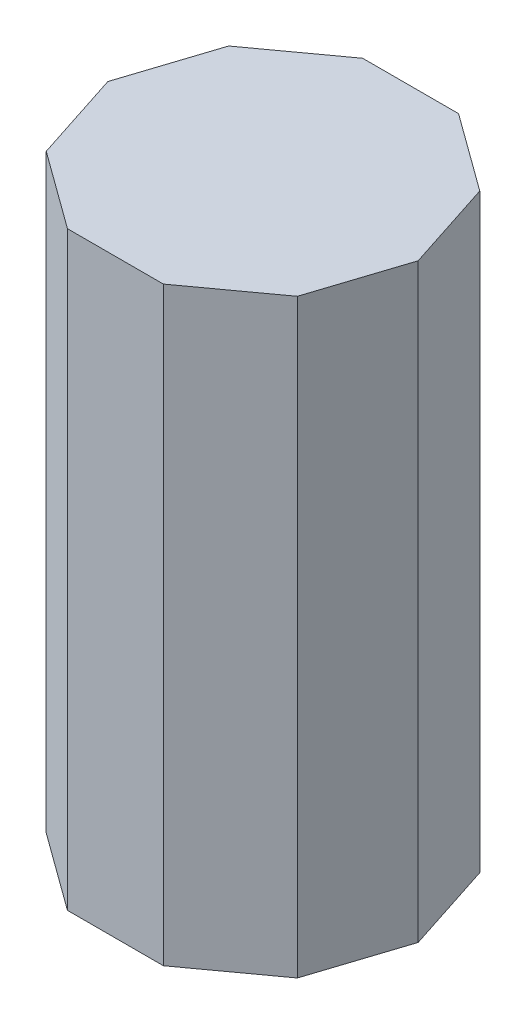
ISO-10303-21;
HEADER;
FILE_DESCRIPTION(('STEP AP214'),'2;1');
FILE_NAME('part.step','',(''),(''),'','','');
FILE_SCHEMA(('AUTOMOTIVE_DESIGN { 1 0 10303 214 1 1 1 1 }'));
ENDSEC;
DATA;
#1=APPLICATION_CONTEXT('core data for automotive mechanical design processes');
#2=APPLICATION_PROTOCOL_DEFINITION('international standard','automotive_design',2000,#1);
#3=PRODUCT_CONTEXT('',#1,'mechanical');
#4=PRODUCT('Part','Part','',(#3));
#5=PRODUCT_RELATED_PRODUCT_CATEGORY('part','',(#4));
#6=PRODUCT_DEFINITION_FORMATION('','',#4);
#7=PRODUCT_DEFINITION_CONTEXT('part definition',#1,'design');
#8=PRODUCT_DEFINITION('design','',#6,#7);
#9=PRODUCT_DEFINITION_SHAPE('','',#8);
#10=(LENGTH_UNIT() NAMED_UNIT(*) SI_UNIT(.MILLI.,.METRE.));
#11=(NAMED_UNIT(*) PLANE_ANGLE_UNIT() SI_UNIT($,.RADIAN.));
#12=(NAMED_UNIT(*) SI_UNIT($,.STERADIAN.) SOLID_ANGLE_UNIT());
#13=UNCERTAINTY_MEASURE_WITH_UNIT(LENGTH_MEASURE(1.E-05),#10,'distance_accuracy_value','');
#14=(GEOMETRIC_REPRESENTATION_CONTEXT(3) GLOBAL_UNCERTAINTY_ASSIGNED_CONTEXT((#13)) GLOBAL_UNIT_ASSIGNED_CONTEXT((#10,
#11,#12)) REPRESENTATION_CONTEXT('',''));
#15=CARTESIAN_POINT('',(0.,0.,0.));
#16=DIRECTION('',(0.,0.,1.));
#17=DIRECTION('',(1.,0.,0.));
#18=AXIS2_PLACEMENT_3D('',#15,#16,#17);
#19=CARTESIAN_POINT('',(1.62459848116453,20.,5.));
#20=DIRECTION('',(-0.587785252292474,0.,-0.809016994374947));
#21=DIRECTION('',(-0.809016994374947,0.,0.587785252292474));
#22=AXIS2_PLACEMENT_3D('',#19,#20,#21);
#23=PLANE('',#22);
#24=DIRECTION('',(0.809016994374947,0.,-0.587785252292474));
#25=VECTOR('',#24,1.);
#26=CARTESIAN_POINT('',(1.62459848116453,0.,5.));
#27=LINE('',#26,#25);
#28=CARTESIAN_POINT('',(1.62459848116453,0.,5.));
#29=VERTEX_POINT('',#28);
#30=CARTESIAN_POINT('',(4.2532540417602,0.,3.09016994374947));
#31=VERTEX_POINT('',#30);
#32=EDGE_CURVE('E110',#29,#31,#27,.T.);
#33=ORIENTED_EDGE('',*,*,#32,.T.);
#34=DIRECTION('',(0.,-1.,0.));
#35=VECTOR('',#34,1.);
#36=CARTESIAN_POINT('',(4.2532540417602,20.,3.09016994374947));
#37=LINE('',#36,#35);
#38=CARTESIAN_POINT('',(4.2532540417602,20.,3.09016994374947));
#39=VERTEX_POINT('',#38);
#40=EDGE_CURVE('E11',#39,#31,#37,.T.);
#41=ORIENTED_EDGE('',*,*,#40,.F.);
#42=DIRECTION('',(0.809016994374947,0.,-0.587785252292474));
#43=VECTOR('',#42,1.);
#44=CARTESIAN_POINT('',(1.62459848116453,20.,5.));
#45=LINE('',#44,#43);
#46=CARTESIAN_POINT('',(1.62459848116453,20.,5.));
#47=VERTEX_POINT('',#46);
#48=EDGE_CURVE('E141',#47,#39,#45,.T.);
#49=ORIENTED_EDGE('',*,*,#48,.F.);
#50=DIRECTION('',(0.,-1.,0.));
#51=VECTOR('',#50,1.);
#52=CARTESIAN_POINT('',(1.62459848116453,20.,5.));
#53=LINE('',#52,#51);
#54=EDGE_CURVE('E123',#47,#29,#53,.T.);
#55=ORIENTED_EDGE('',*,*,#54,.T.);
#56=EDGE_LOOP('',(#33,#41,#49,#55));
#57=FACE_BOUND('',#56,.T.);
#58=ADVANCED_FACE('F30',(#57),#23,.F.);
#59=CARTESIAN_POINT('',(4.2532540417602,20.,3.09016994374947));
#60=DIRECTION('',(-0.951056516295154,0.,-0.309016994374947));
#61=DIRECTION('',(-0.309016994374947,0.,0.951056516295154));
#62=AXIS2_PLACEMENT_3D('',#59,#60,#61);
#63=PLANE('',#62);
#64=DIRECTION('',(0.309016994374947,0.,-0.951056516295154));
#65=VECTOR('',#64,1.);
#66=CARTESIAN_POINT('',(4.2532540417602,0.,3.09016994374947));
#67=LINE('',#66,#65);
#68=CARTESIAN_POINT('',(5.25731112119134,0.,0.));
#69=VERTEX_POINT('',#68);
#70=EDGE_CURVE('E106',#31,#69,#67,.T.);
#71=ORIENTED_EDGE('',*,*,#70,.T.);
#72=DIRECTION('',(0.,-1.,0.));
#73=VECTOR('',#72,1.);
#74=CARTESIAN_POINT('',(5.25731112119134,20.,0.));
#75=LINE('',#74,#73);
#76=CARTESIAN_POINT('',(5.25731112119134,20.,0.));
#77=VERTEX_POINT('',#76);
#78=EDGE_CURVE('E37',#77,#69,#75,.T.);
#79=ORIENTED_EDGE('',*,*,#78,.F.);
#80=DIRECTION('',(0.309016994374947,0.,-0.951056516295154));
#81=VECTOR('',#80,1.);
#82=CARTESIAN_POINT('',(4.2532540417602,20.,3.09016994374947));
#83=LINE('',#82,#81);
#84=EDGE_CURVE('E119',#39,#77,#83,.T.);
#85=ORIENTED_EDGE('',*,*,#84,.F.);
#86=ORIENTED_EDGE('',*,*,#40,.T.);
#87=EDGE_LOOP('',(#71,#79,#85,#86));
#88=FACE_BOUND('',#87,.T.);
#89=ADVANCED_FACE('F118',(#88),#63,.F.);
#90=CARTESIAN_POINT('',(5.25731112119134,20.,0.));
#91=DIRECTION('',(-0.951056516295154,0.,0.309016994374947));
#92=DIRECTION('',(0.309016994374947,0.,0.951056516295154));
#93=AXIS2_PLACEMENT_3D('',#90,#91,#92);
#94=PLANE('',#93);
#95=DIRECTION('',(-0.309016994374947,0.,-0.951056516295154));
#96=VECTOR('',#95,1.);
#97=CARTESIAN_POINT('',(5.25731112119134,0.,0.));
#98=LINE('',#97,#96);
#99=CARTESIAN_POINT('',(4.25325404176021,0.,-3.09016994374946));
#100=VERTEX_POINT('',#99);
#101=EDGE_CURVE('E112',#69,#100,#98,.T.);
#102=ORIENTED_EDGE('',*,*,#101,.T.);
#103=DIRECTION('',(0.,-1.,0.));
#104=VECTOR('',#103,1.);
#105=CARTESIAN_POINT('',(4.25325404176021,20.,-3.09016994374946));
#106=LINE('',#105,#104);
#107=CARTESIAN_POINT('',(4.25325404176021,20.,-3.09016994374946));
#108=VERTEX_POINT('',#107);
#109=EDGE_CURVE('E177',#108,#100,#106,.T.);
#110=ORIENTED_EDGE('',*,*,#109,.F.);
#111=DIRECTION('',(-0.309016994374947,0.,-0.951056516295154));
#112=VECTOR('',#111,1.);
#113=CARTESIAN_POINT('',(5.25731112119134,20.,0.));
#114=LINE('',#113,#112);
#115=EDGE_CURVE('E144',#77,#108,#114,.T.);
#116=ORIENTED_EDGE('',*,*,#115,.F.);
#117=ORIENTED_EDGE('',*,*,#78,.T.);
#118=EDGE_LOOP('',(#102,#110,#116,#117));
#119=FACE_BOUND('',#118,.T.);
#120=ADVANCED_FACE('F181',(#119),#94,.F.);
#121=CARTESIAN_POINT('',(4.25325404176021,20.,-3.09016994374946));
#122=DIRECTION('',(-0.587785252292473,0.,0.809016994374947));
#123=DIRECTION('',(0.809016994374947,0.,0.587785252292473));
#124=AXIS2_PLACEMENT_3D('',#121,#122,#123);
#125=PLANE('',#124);
#126=DIRECTION('',(-0.809016994374947,0.,-0.587785252292473));
#127=VECTOR('',#126,1.);
#128=CARTESIAN_POINT('',(4.25325404176021,0.,-3.09016994374946));
#129=LINE('',#128,#127);
#130=CARTESIAN_POINT('',(1.62459848116451,0.,-5.00000000000001));
#131=VERTEX_POINT('',#130);
#132=EDGE_CURVE('E127',#100,#131,#129,.T.);
#133=ORIENTED_EDGE('',*,*,#132,.T.);
#134=DIRECTION('',(0.,-1.,0.));
#135=VECTOR('',#134,1.);
#136=CARTESIAN_POINT('',(1.62459848116451,20.,-5.00000000000001));
#137=LINE('',#136,#135);
#138=CARTESIAN_POINT('',(1.62459848116451,20.,-5.00000000000001));
#139=VERTEX_POINT('',#138);
#140=EDGE_CURVE('E174',#139,#131,#137,.T.);
#141=ORIENTED_EDGE('',*,*,#140,.F.);
#142=DIRECTION('',(-0.809016994374947,0.,-0.587785252292473));
#143=VECTOR('',#142,1.);
#144=CARTESIAN_POINT('',(4.25325404176021,20.,-3.09016994374946));
#145=LINE('',#144,#143);
#146=EDGE_CURVE('E146',#108,#139,#145,.T.);
#147=ORIENTED_EDGE('',*,*,#146,.F.);
#148=ORIENTED_EDGE('',*,*,#109,.T.);
#149=EDGE_LOOP('',(#133,#141,#147,#148));
#150=FACE_BOUND('',#149,.T.);
#151=ADVANCED_FACE('F189',(#150),#125,.F.);
#152=CARTESIAN_POINT('',(1.62459848116451,20.,-5.00000000000001));
#153=DIRECTION('',(0.,0.,1.));
#154=DIRECTION('',(1.,0.,0.));
#155=AXIS2_PLACEMENT_3D('',#152,#153,#154);
#156=PLANE('',#155);
#157=DIRECTION('',(-1.,0.,0.));
#158=VECTOR('',#157,1.);
#159=CARTESIAN_POINT('',(1.62459848116451,0.,-5.00000000000001));
#160=LINE('',#159,#158);
#161=CARTESIAN_POINT('',(-1.62459848116453,0.,-5.00000000000001));
#162=VERTEX_POINT('',#161);
#163=EDGE_CURVE('E129',#131,#162,#160,.T.);
#164=ORIENTED_EDGE('',*,*,#163,.T.);
#165=DIRECTION('',(0.,-1.,0.));
#166=VECTOR('',#165,1.);
#167=CARTESIAN_POINT('',(-1.62459848116453,20.,-5.00000000000001));
#168=LINE('',#167,#166);
#169=CARTESIAN_POINT('',(-1.62459848116453,20.,-5.00000000000001));
#170=VERTEX_POINT('',#169);
#171=EDGE_CURVE('E171',#170,#162,#168,.T.);
#172=ORIENTED_EDGE('',*,*,#171,.F.);
#173=DIRECTION('',(-1.,0.,0.));
#174=VECTOR('',#173,1.);
#175=CARTESIAN_POINT('',(1.62459848116451,20.,-5.00000000000001));
#176=LINE('',#175,#174);
#177=EDGE_CURVE('E148',#139,#170,#176,.T.);
#178=ORIENTED_EDGE('',*,*,#177,.F.);
#179=ORIENTED_EDGE('',*,*,#140,.T.);
#180=EDGE_LOOP('',(#164,#172,#178,#179));
#181=FACE_BOUND('',#180,.T.);
#182=ADVANCED_FACE('F192',(#181),#156,.F.);
#183=CARTESIAN_POINT('',(-1.62459848116453,20.,-5.00000000000001));
#184=DIRECTION('',(0.587785252292473,0.,0.809016994374947));
#185=DIRECTION('',(0.809016994374947,0.,-0.587785252292473));
#186=AXIS2_PLACEMENT_3D('',#183,#184,#185);
#187=PLANE('',#186);
#188=DIRECTION('',(-0.809016994374947,0.,0.587785252292473));
#189=VECTOR('',#188,1.);
#190=CARTESIAN_POINT('',(-1.62459848116453,0.,-5.00000000000001));
#191=LINE('',#190,#189);
#192=CARTESIAN_POINT('',(-4.25325404176022,0.,-3.09016994374947));
#193=VERTEX_POINT('',#192);
#194=EDGE_CURVE('E131',#162,#193,#191,.T.);
#195=ORIENTED_EDGE('',*,*,#194,.T.);
#196=DIRECTION('',(0.,-1.,0.));
#197=VECTOR('',#196,1.);
#198=CARTESIAN_POINT('',(-4.25325404176022,20.,-3.09016994374947));
#199=LINE('',#198,#197);
#200=CARTESIAN_POINT('',(-4.25325404176022,20.,-3.09016994374947));
#201=VERTEX_POINT('',#200);
#202=EDGE_CURVE('E168',#201,#193,#199,.T.);
#203=ORIENTED_EDGE('',*,*,#202,.F.);
#204=DIRECTION('',(-0.809016994374947,0.,0.587785252292473));
#205=VECTOR('',#204,1.);
#206=CARTESIAN_POINT('',(-1.62459848116453,20.,-5.00000000000001));
#207=LINE('',#206,#205);
#208=EDGE_CURVE('E150',#170,#201,#207,.T.);
#209=ORIENTED_EDGE('',*,*,#208,.F.);
#210=ORIENTED_EDGE('',*,*,#171,.T.);
#211=EDGE_LOOP('',(#195,#203,#209,#210));
#212=FACE_BOUND('',#211,.T.);
#213=ADVANCED_FACE('F197',(#212),#187,.F.);
#214=CARTESIAN_POINT('',(-4.25325404176022,20.,-3.09016994374947));
#215=DIRECTION('',(0.951056516295154,0.,0.309016994374948));
#216=DIRECTION('',(0.309016994374948,0.,-0.951056516295154));
#217=AXIS2_PLACEMENT_3D('',#214,#215,#216);
#218=PLANE('',#217);
#219=DIRECTION('',(-0.309016994374948,0.,0.951056516295154));
#220=VECTOR('',#219,1.);
#221=CARTESIAN_POINT('',(-4.25325404176022,0.,-3.09016994374947));
#222=LINE('',#221,#220);
#223=CARTESIAN_POINT('',(-5.25731112119135,0.,0.));
#224=VERTEX_POINT('',#223);
#225=EDGE_CURVE('E133',#193,#224,#222,.T.);
#226=ORIENTED_EDGE('',*,*,#225,.T.);
#227=DIRECTION('',(0.,-1.,0.));
#228=VECTOR('',#227,1.);
#229=CARTESIAN_POINT('',(-5.25731112119135,20.,0.));
#230=LINE('',#229,#228);
#231=CARTESIAN_POINT('',(-5.25731112119135,20.,0.));
#232=VERTEX_POINT('',#231);
#233=EDGE_CURVE('E165',#232,#224,#230,.T.);
#234=ORIENTED_EDGE('',*,*,#233,.F.);
#235=DIRECTION('',(-0.309016994374948,0.,0.951056516295154));
#236=VECTOR('',#235,1.);
#237=CARTESIAN_POINT('',(-4.25325404176022,20.,-3.09016994374947));
#238=LINE('',#237,#236);
#239=EDGE_CURVE('E152',#201,#232,#238,.T.);
#240=ORIENTED_EDGE('',*,*,#239,.F.);
#241=ORIENTED_EDGE('',*,*,#202,.T.);
#242=EDGE_LOOP('',(#226,#234,#240,#241));
#243=FACE_BOUND('',#242,.T.);
#244=ADVANCED_FACE('F203',(#243),#218,.F.);
#245=CARTESIAN_POINT('',(-5.25731112119135,20.,0.));
#246=DIRECTION('',(0.951056516295154,0.,-0.309016994374948));
#247=DIRECTION('',(-0.309016994374948,0.,-0.951056516295154));
#248=AXIS2_PLACEMENT_3D('',#245,#246,#247);
#249=PLANE('',#248);
#250=DIRECTION('',(0.309016994374948,0.,0.951056516295154));
#251=VECTOR('',#250,1.);
#252=CARTESIAN_POINT('',(-5.25731112119135,0.,0.));
#253=LINE('',#252,#251);
#254=CARTESIAN_POINT('',(-4.25325404176021,0.,3.09016994374948));
#255=VERTEX_POINT('',#254);
#256=EDGE_CURVE('E135',#224,#255,#253,.T.);
#257=ORIENTED_EDGE('',*,*,#256,.T.);
#258=DIRECTION('',(0.,-1.,0.));
#259=VECTOR('',#258,1.);
#260=CARTESIAN_POINT('',(-4.25325404176021,20.,3.09016994374948));
#261=LINE('',#260,#259);
#262=CARTESIAN_POINT('',(-4.25325404176021,20.,3.09016994374948));
#263=VERTEX_POINT('',#262);
#264=EDGE_CURVE('E162',#263,#255,#261,.T.);
#265=ORIENTED_EDGE('',*,*,#264,.F.);
#266=DIRECTION('',(0.309016994374948,0.,0.951056516295154));
#267=VECTOR('',#266,1.);
#268=CARTESIAN_POINT('',(-5.25731112119135,20.,0.));
#269=LINE('',#268,#267);
#270=EDGE_CURVE('E154',#232,#263,#269,.T.);
#271=ORIENTED_EDGE('',*,*,#270,.F.);
#272=ORIENTED_EDGE('',*,*,#233,.T.);
#273=EDGE_LOOP('',(#257,#265,#271,#272));
#274=FACE_BOUND('',#273,.T.);
#275=ADVANCED_FACE('F207',(#274),#249,.F.);
#276=CARTESIAN_POINT('',(-4.25325404176021,20.,3.09016994374948));
#277=DIRECTION('',(0.587785252292473,0.,-0.809016994374947));
#278=DIRECTION('',(-0.809016994374947,0.,-0.587785252292473));
#279=AXIS2_PLACEMENT_3D('',#276,#277,#278);
#280=PLANE('',#279);
#281=DIRECTION('',(0.809016994374947,0.,0.587785252292473));
#282=VECTOR('',#281,1.);
#283=CARTESIAN_POINT('',(-4.25325404176021,0.,3.09016994374948));
#284=LINE('',#283,#282);
#285=CARTESIAN_POINT('',(-1.62459848116455,0.,5.));
#286=VERTEX_POINT('',#285);
#287=EDGE_CURVE('E137',#255,#286,#284,.T.);
#288=ORIENTED_EDGE('',*,*,#287,.T.);
#289=DIRECTION('',(0.,-1.,0.));
#290=VECTOR('',#289,1.);
#291=CARTESIAN_POINT('',(-1.62459848116455,20.,5.));
#292=LINE('',#291,#290);
#293=CARTESIAN_POINT('',(-1.62459848116455,20.,5.));
#294=VERTEX_POINT('',#293);
#295=EDGE_CURVE('E159',#294,#286,#292,.T.);
#296=ORIENTED_EDGE('',*,*,#295,.F.);
#297=DIRECTION('',(0.809016994374947,0.,0.587785252292473));
#298=VECTOR('',#297,1.);
#299=CARTESIAN_POINT('',(-4.25325404176021,20.,3.09016994374948));
#300=LINE('',#299,#298);
#301=EDGE_CURVE('E49',#263,#294,#300,.T.);
#302=ORIENTED_EDGE('',*,*,#301,.F.);
#303=ORIENTED_EDGE('',*,*,#264,.T.);
#304=EDGE_LOOP('',(#288,#296,#302,#303));
#305=FACE_BOUND('',#304,.T.);
#306=ADVANCED_FACE('F210',(#305),#280,.F.);
#307=CARTESIAN_POINT('',(-1.62459848116455,20.,5.));
#308=DIRECTION('',(0.,0.,-1.));
#309=DIRECTION('',(-1.,0.,0.));
#310=AXIS2_PLACEMENT_3D('',#307,#308,#309);
#311=PLANE('',#310);
#312=DIRECTION('',(1.,0.,0.));
#313=VECTOR('',#312,1.);
#314=CARTESIAN_POINT('',(-1.62459848116455,0.,5.));
#315=LINE('',#314,#313);
#316=EDGE_CURVE('E139',#286,#29,#315,.T.);
#317=ORIENTED_EDGE('',*,*,#316,.T.);
#318=ORIENTED_EDGE('',*,*,#54,.F.);
#319=DIRECTION('',(1.,0.,0.));
#320=VECTOR('',#319,1.);
#321=CARTESIAN_POINT('',(-1.62459848116455,20.,5.));
#322=LINE('',#321,#320);
#323=EDGE_CURVE('E44',#294,#47,#322,.T.);
#324=ORIENTED_EDGE('',*,*,#323,.F.);
#325=ORIENTED_EDGE('',*,*,#295,.T.);
#326=EDGE_LOOP('',(#317,#318,#324,#325));
#327=FACE_BOUND('',#326,.T.);
#328=ADVANCED_FACE('F212',(#327),#311,.F.);
#329=CARTESIAN_POINT('',(8.50650808352039,20.,0.));
#330=DIRECTION('',(0.,1.,0.));
#331=DIRECTION('',(0.,0.,1.));
#332=AXIS2_PLACEMENT_3D('',#329,#330,#331);
#333=PLANE('',#332);
#334=ORIENTED_EDGE('',*,*,#48,.T.);
#335=ORIENTED_EDGE('',*,*,#84,.T.);
#336=ORIENTED_EDGE('',*,*,#115,.T.);
#337=ORIENTED_EDGE('',*,*,#146,.T.);
#338=ORIENTED_EDGE('',*,*,#177,.T.);
#339=ORIENTED_EDGE('',*,*,#208,.T.);
#340=ORIENTED_EDGE('',*,*,#239,.T.);
#341=ORIENTED_EDGE('',*,*,#270,.T.);
#342=ORIENTED_EDGE('',*,*,#301,.T.);
#343=ORIENTED_EDGE('',*,*,#323,.T.);
#344=EDGE_LOOP('',(#334,#335,#336,#337,#338,#339,#340,#341,#342,#343));
#345=FACE_BOUND('',#344,.T.);
#346=ADVANCED_FACE('F184',(#345),#333,.T.);
#347=CARTESIAN_POINT('',(8.50650808352039,0.,0.));
#348=DIRECTION('',(0.,1.,0.));
#349=DIRECTION('',(0.,0.,1.));
#350=AXIS2_PLACEMENT_3D('',#347,#348,#349);
#351=PLANE('',#350);
#352=ORIENTED_EDGE('',*,*,#32,.F.);
#353=ORIENTED_EDGE('',*,*,#316,.F.);
#354=ORIENTED_EDGE('',*,*,#287,.F.);
#355=ORIENTED_EDGE('',*,*,#256,.F.);
#356=ORIENTED_EDGE('',*,*,#225,.F.);
#357=ORIENTED_EDGE('',*,*,#194,.F.);
#358=ORIENTED_EDGE('',*,*,#163,.F.);
#359=ORIENTED_EDGE('',*,*,#132,.F.);
#360=ORIENTED_EDGE('',*,*,#101,.F.);
#361=ORIENTED_EDGE('',*,*,#70,.F.);
#362=EDGE_LOOP('',(#352,#353,#354,#355,#356,#357,#358,#359,#360,#361));
#363=FACE_BOUND('',#362,.T.);
#364=ADVANCED_FACE('F107',(#363),#351,.F.);
#365=CLOSED_SHELL('',(#58,#89,#120,#151,#182,#213,#244,#275,#306,#328,#346,#364));
#366=MANIFOLD_SOLID_BREP('B2',#365);
#367=ADVANCED_BREP_SHAPE_REPRESENTATION('',(#18,#366),#14);
#368=SHAPE_DEFINITION_REPRESENTATION(#9,#367);
ENDSEC;
END-ISO-10303-21;
